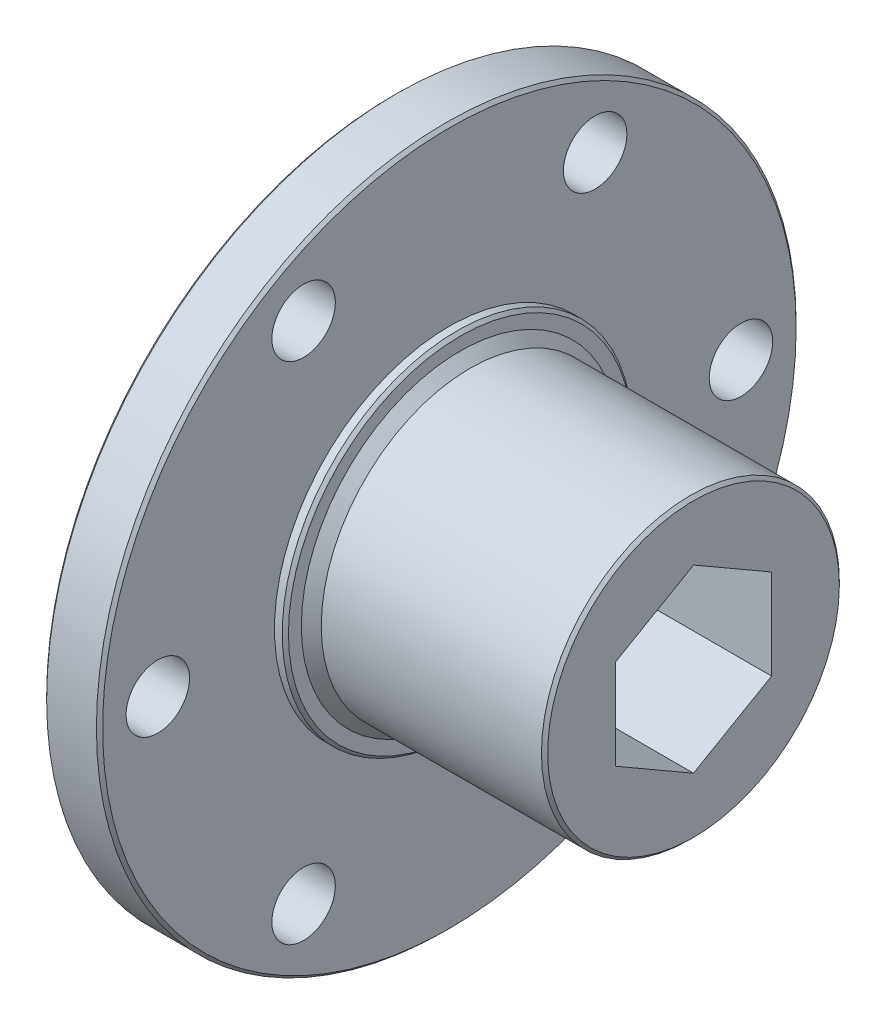
ISO-10303-21;
HEADER;
FILE_DESCRIPTION(('STEP AP214'),'2;1');
FILE_NAME('part.step','',(''),(''),'','','');
FILE_SCHEMA(('AUTOMOTIVE_DESIGN { 1 0 10303 214 1 1 1 1 }'));
ENDSEC;
DATA;
#1=APPLICATION_CONTEXT('core data for automotive mechanical design processes');
#2=APPLICATION_PROTOCOL_DEFINITION('international standard','automotive_design',2000,#1);
#3=PRODUCT_CONTEXT('',#1,'mechanical');
#4=PRODUCT('Part','Part','',(#3));
#5=PRODUCT_RELATED_PRODUCT_CATEGORY('part','',(#4));
#6=PRODUCT_DEFINITION_FORMATION('','',#4);
#7=PRODUCT_DEFINITION_CONTEXT('part definition',#1,'design');
#8=PRODUCT_DEFINITION('design','',#6,#7);
#9=PRODUCT_DEFINITION_SHAPE('','',#8);
#10=(LENGTH_UNIT() NAMED_UNIT(*) SI_UNIT(.MILLI.,.METRE.));
#11=(NAMED_UNIT(*) PLANE_ANGLE_UNIT() SI_UNIT($,.RADIAN.));
#12=(NAMED_UNIT(*) SI_UNIT($,.STERADIAN.) SOLID_ANGLE_UNIT());
#13=UNCERTAINTY_MEASURE_WITH_UNIT(LENGTH_MEASURE(1.E-05),#10,'distance_accuracy_value','');
#14=(GEOMETRIC_REPRESENTATION_CONTEXT(3) GLOBAL_UNCERTAINTY_ASSIGNED_CONTEXT((#13)) GLOBAL_UNIT_ASSIGNED_CONTEXT((#10,
#11,#12)) REPRESENTATION_CONTEXT('',''));
#15=CARTESIAN_POINT('',(0.,0.,0.));
#16=DIRECTION('',(0.,0.,1.));
#17=DIRECTION('',(1.,0.,0.));
#18=AXIS2_PLACEMENT_3D('',#15,#16,#17);
#19=CARTESIAN_POINT('',(-13.9240662460568,0.,0.));
#20=DIRECTION('',(-1.,0.,0.));
#21=DIRECTION('',(0.,0.,1.));
#22=AXIS2_PLACEMENT_3D('',#19,#20,#21);
#23=CYLINDRICAL_SURFACE('',#22,28.575);
#24=CARTESIAN_POINT('',(-18.2420662460566,0.,0.));
#25=DIRECTION('',(-1.,0.,0.));
#26=DIRECTION('',(0.,0.,1.));
#27=AXIS2_PLACEMENT_3D('',#24,#25,#26);
#28=CIRCLE('',#27,28.575);
#29=CARTESIAN_POINT('',(-18.2420662460566,0.,28.575));
#30=VERTEX_POINT('',#29);
#31=EDGE_CURVE('E169',#30,#30,#28,.F.);
#32=ORIENTED_EDGE('',*,*,#31,.T.);
#33=EDGE_LOOP('',(#32));
#34=FACE_BOUND('',#33,.T.);
#35=CARTESIAN_POINT('',(-14.1780662460569,0.,0.));
#36=DIRECTION('',(1.,0.,0.));
#37=DIRECTION('',(0.,0.,-1.));
#38=AXIS2_PLACEMENT_3D('',#35,#36,#37);
#39=CIRCLE('',#38,28.575);
#40=CARTESIAN_POINT('',(-14.1780662460569,0.,-28.575));
#41=VERTEX_POINT('',#40);
#42=EDGE_CURVE('E166',#41,#41,#39,.F.);
#43=ORIENTED_EDGE('',*,*,#42,.T.);
#44=EDGE_LOOP('',(#43));
#45=FACE_BOUND('',#44,.T.);
#46=ADVANCED_FACE('F32',(#34,#45),#23,.T.);
#47=CARTESIAN_POINT('',(-13.9240662460568,28.575,0.));
#48=DIRECTION('',(1.,0.,0.));
#49=DIRECTION('',(0.,0.,-1.));
#50=AXIS2_PLACEMENT_3D('',#47,#48,#49);
#51=PLANE('',#50);
#52=CARTESIAN_POINT('',(-13.9240662460568,0.,0.));
#53=DIRECTION('',(1.,0.,0.));
#54=DIRECTION('',(0.,0.,-1.));
#55=AXIS2_PLACEMENT_3D('',#52,#53,#54);
#56=CIRCLE('',#55,28.3209999999999);
#57=CARTESIAN_POINT('',(-13.9240662460568,0.,-28.3209999999999));
#58=VERTEX_POINT('',#57);
#59=EDGE_CURVE('E11',#58,#58,#56,.T.);
#60=ORIENTED_EDGE('',*,*,#59,.T.);
#61=EDGE_LOOP('',(#60));
#62=FACE_BOUND('',#61,.T.);
#63=CARTESIAN_POINT('',(-13.9240662460568,20.6222299276169,11.90625));
#64=DIRECTION('',(1.,0.,0.));
#65=DIRECTION('',(0.,0.,-1.));
#66=AXIS2_PLACEMENT_3D('',#63,#64,#65);
#67=CIRCLE('',#66,2.59080000000003);
#68=CARTESIAN_POINT('',(-13.9240662460568,20.6222299276169,9.31544999999998));
#69=VERTEX_POINT('',#68);
#70=EDGE_CURVE('E321',#69,#69,#67,.T.);
#71=ORIENTED_EDGE('',*,*,#70,.F.);
#72=EDGE_LOOP('',(#71));
#73=FACE_BOUND('',#72,.T.);
#74=CARTESIAN_POINT('',(-13.9240662460568,0.,-23.8125));
#75=DIRECTION('',(1.,0.,0.));
#76=DIRECTION('',(0.,0.,-1.));
#77=AXIS2_PLACEMENT_3D('',#74,#75,#76);
#78=CIRCLE('',#77,2.59080000000003);
#79=CARTESIAN_POINT('',(-13.9240662460568,0.,-26.4033));
#80=VERTEX_POINT('',#79);
#81=EDGE_CURVE('E326',#80,#80,#78,.T.);
#82=ORIENTED_EDGE('',*,*,#81,.F.);
#83=EDGE_LOOP('',(#82));
#84=FACE_BOUND('',#83,.T.);
#85=CARTESIAN_POINT('',(-13.9240662460568,-20.622229927617,11.9062499999999));
#86=DIRECTION('',(1.,0.,0.));
#87=DIRECTION('',(0.,0.,-1.));
#88=AXIS2_PLACEMENT_3D('',#85,#86,#87);
#89=CIRCLE('',#88,2.59080000000003);
#90=CARTESIAN_POINT('',(-13.9240662460568,-20.622229927617,9.31544999999992));
#91=VERTEX_POINT('',#90);
#92=EDGE_CURVE('E330',#91,#91,#89,.T.);
#93=ORIENTED_EDGE('',*,*,#92,.F.);
#94=EDGE_LOOP('',(#93));
#95=FACE_BOUND('',#94,.T.);
#96=CARTESIAN_POINT('',(-13.9240662460568,-20.6222299276169,-11.90625));
#97=DIRECTION('',(1.,0.,0.));
#98=DIRECTION('',(0.,0.,-1.));
#99=AXIS2_PLACEMENT_3D('',#96,#97,#98);
#100=CIRCLE('',#99,2.59080000000003);
#101=CARTESIAN_POINT('',(-13.9240662460568,-20.6222299276169,-14.4970500000001));
#102=VERTEX_POINT('',#101);
#103=EDGE_CURVE('E334',#102,#102,#100,.T.);
#104=ORIENTED_EDGE('',*,*,#103,.F.);
#105=EDGE_LOOP('',(#104));
#106=FACE_BOUND('',#105,.T.);
#107=CARTESIAN_POINT('',(-13.9240662460568,20.622229927617,-11.90625));
#108=DIRECTION('',(1.,0.,0.));
#109=DIRECTION('',(0.,0.,-1.));
#110=AXIS2_PLACEMENT_3D('',#107,#108,#109);
#111=CIRCLE('',#110,2.59080000000003);
#112=CARTESIAN_POINT('',(-13.9240662460568,20.622229927617,-14.49705));
#113=VERTEX_POINT('',#112);
#114=EDGE_CURVE('E338',#113,#113,#111,.T.);
#115=ORIENTED_EDGE('',*,*,#114,.F.);
#116=EDGE_LOOP('',(#115));
#117=FACE_BOUND('',#116,.T.);
#118=CARTESIAN_POINT('',(-13.9240662460568,0.,23.8125));
#119=DIRECTION('',(1.,0.,0.));
#120=DIRECTION('',(0.,0.,-1.));
#121=AXIS2_PLACEMENT_3D('',#118,#119,#120);
#122=CIRCLE('',#121,2.59080000000003);
#123=CARTESIAN_POINT('',(-13.9240662460568,0.,21.2217));
#124=VERTEX_POINT('',#123);
#125=EDGE_CURVE('E109',#124,#124,#122,.T.);
#126=ORIENTED_EDGE('',*,*,#125,.F.);
#127=EDGE_LOOP('',(#126));
#128=FACE_BOUND('',#127,.T.);
#129=CARTESIAN_POINT('',(-13.9240662460568,0.,0.));
#130=DIRECTION('',(1.,0.,0.));
#131=DIRECTION('',(0.,0.,-1.));
#132=AXIS2_PLACEMENT_3D('',#129,#130,#131);
#133=CIRCLE('',#132,14.2875);
#134=CARTESIAN_POINT('',(-13.9240662460568,0.,-14.2875));
#135=VERTEX_POINT('',#134);
#136=EDGE_CURVE('E148',#135,#135,#133,.T.);
#137=ORIENTED_EDGE('',*,*,#136,.F.);
#138=EDGE_LOOP('',(#137));
#139=FACE_BOUND('',#138,.T.);
#140=ADVANCED_FACE('F204',(#62,#73,#84,#95,#106,#117,#128,#139),#51,.T.);
#141=CARTESIAN_POINT('',(-18.4960662460568,0.,0.));
#142=DIRECTION('',(-1.,0.,0.));
#143=DIRECTION('',(0.,0.,1.));
#144=AXIS2_PLACEMENT_3D('',#141,#142,#143);
#145=PLANE('',#144);
#146=CARTESIAN_POINT('',(-18.4960662460568,0.,0.));
#147=DIRECTION('',(-1.,0.,0.));
#148=DIRECTION('',(0.,0.,1.));
#149=AXIS2_PLACEMENT_3D('',#146,#147,#148);
#150=CIRCLE('',#149,28.3209999999999);
#151=CARTESIAN_POINT('',(-18.4960662460568,0.,28.3209999999999));
#152=VERTEX_POINT('',#151);
#153=EDGE_CURVE('E163',#152,#152,#150,.T.);
#154=ORIENTED_EDGE('',*,*,#153,.T.);
#155=EDGE_LOOP('',(#154));
#156=FACE_BOUND('',#155,.T.);
#157=CARTESIAN_POINT('',(-18.4960662460568,20.6222299276169,11.90625));
#158=DIRECTION('',(-1.,0.,0.));
#159=DIRECTION('',(0.,0.,1.));
#160=AXIS2_PLACEMENT_3D('',#157,#158,#159);
#161=CIRCLE('',#160,2.59080000000003);
#162=CARTESIAN_POINT('',(-18.4960662460568,20.6222299276169,14.49705));
#163=VERTEX_POINT('',#162);
#164=EDGE_CURVE('E238',#163,#163,#161,.T.);
#165=ORIENTED_EDGE('',*,*,#164,.F.);
#166=EDGE_LOOP('',(#165));
#167=FACE_BOUND('',#166,.T.);
#168=CARTESIAN_POINT('',(-18.4960662460568,0.,-23.8125));
#169=DIRECTION('',(-1.,0.,0.));
#170=DIRECTION('',(0.,0.,1.));
#171=AXIS2_PLACEMENT_3D('',#168,#169,#170);
#172=CIRCLE('',#171,2.59080000000003);
#173=CARTESIAN_POINT('',(-18.4960662460568,0.,-21.2217));
#174=VERTEX_POINT('',#173);
#175=EDGE_CURVE('E242',#174,#174,#172,.T.);
#176=ORIENTED_EDGE('',*,*,#175,.F.);
#177=EDGE_LOOP('',(#176));
#178=FACE_BOUND('',#177,.T.);
#179=CARTESIAN_POINT('',(-18.4960662460568,-20.622229927617,11.9062499999999));
#180=DIRECTION('',(-1.,0.,0.));
#181=DIRECTION('',(0.,0.,1.));
#182=AXIS2_PLACEMENT_3D('',#179,#180,#181);
#183=CIRCLE('',#182,2.59080000000003);
#184=CARTESIAN_POINT('',(-18.4960662460568,-20.622229927617,14.49705));
#185=VERTEX_POINT('',#184);
#186=EDGE_CURVE('E246',#185,#185,#183,.T.);
#187=ORIENTED_EDGE('',*,*,#186,.F.);
#188=EDGE_LOOP('',(#187));
#189=FACE_BOUND('',#188,.T.);
#190=CARTESIAN_POINT('',(-18.4960662460568,-20.6222299276169,-11.90625));
#191=DIRECTION('',(-1.,0.,0.));
#192=DIRECTION('',(0.,0.,1.));
#193=AXIS2_PLACEMENT_3D('',#190,#191,#192);
#194=CIRCLE('',#193,2.59080000000003);
#195=CARTESIAN_POINT('',(-18.4960662460568,-20.6222299276169,-9.31545000000002));
#196=VERTEX_POINT('',#195);
#197=EDGE_CURVE('E250',#196,#196,#194,.T.);
#198=ORIENTED_EDGE('',*,*,#197,.F.);
#199=EDGE_LOOP('',(#198));
#200=FACE_BOUND('',#199,.T.);
#201=CARTESIAN_POINT('',(-18.4960662460568,20.622229927617,-11.90625));
#202=DIRECTION('',(-1.,0.,0.));
#203=DIRECTION('',(0.,0.,1.));
#204=AXIS2_PLACEMENT_3D('',#201,#202,#203);
#205=CIRCLE('',#204,2.59080000000003);
#206=CARTESIAN_POINT('',(-18.4960662460568,20.622229927617,-9.31544999999995));
#207=VERTEX_POINT('',#206);
#208=EDGE_CURVE('E254',#207,#207,#205,.T.);
#209=ORIENTED_EDGE('',*,*,#208,.F.);
#210=EDGE_LOOP('',(#209));
#211=FACE_BOUND('',#210,.T.);
#212=CARTESIAN_POINT('',(-18.4960662460568,0.,23.8125));
#213=DIRECTION('',(-1.,0.,0.));
#214=DIRECTION('',(0.,0.,1.));
#215=AXIS2_PLACEMENT_3D('',#212,#213,#214);
#216=CIRCLE('',#215,2.59080000000003);
#217=CARTESIAN_POINT('',(-18.4960662460568,0.,26.4033));
#218=VERTEX_POINT('',#217);
#219=EDGE_CURVE('E258',#218,#218,#216,.T.);
#220=ORIENTED_EDGE('',*,*,#219,.F.);
#221=EDGE_LOOP('',(#220));
#222=FACE_BOUND('',#221,.T.);
#223=CARTESIAN_POINT('',(-18.4960662460568,0.,0.));
#224=DIRECTION('',(-1.,0.,0.));
#225=DIRECTION('',(0.,0.,1.));
#226=AXIS2_PLACEMENT_3D('',#223,#224,#225);
#227=CIRCLE('',#226,14.2875);
#228=CARTESIAN_POINT('',(-18.4960662460568,0.,14.2875));
#229=VERTEX_POINT('',#228);
#230=EDGE_CURVE('E132',#229,#229,#227,.T.);
#231=ORIENTED_EDGE('',*,*,#230,.F.);
#232=EDGE_LOOP('',(#231));
#233=FACE_BOUND('',#232,.T.);
#234=ADVANCED_FACE('F210',(#156,#167,#178,#189,#200,#211,#222,#233),#145,.T.);
#235=CARTESIAN_POINT('',(-13.0350662460568,0.,0.));
#236=DIRECTION('',(-1.,0.,0.));
#237=DIRECTION('',(0.,0.,1.));
#238=AXIS2_PLACEMENT_3D('',#235,#236,#237);
#239=CYLINDRICAL_SURFACE('',#238,14.2875);
#240=CARTESIAN_POINT('',(-13.2890662460569,0.,0.));
#241=DIRECTION('',(1.,0.,0.));
#242=DIRECTION('',(0.,0.,-1.));
#243=AXIS2_PLACEMENT_3D('',#240,#241,#242);
#244=CIRCLE('',#243,14.2875);
#245=CARTESIAN_POINT('',(-13.2890662460569,0.,-14.2875));
#246=VERTEX_POINT('',#245);
#247=EDGE_CURVE('E40',#246,#246,#244,.F.);
#248=ORIENTED_EDGE('',*,*,#247,.T.);
#249=EDGE_LOOP('',(#248));
#250=FACE_BOUND('',#249,.T.);
#251=ORIENTED_EDGE('',*,*,#136,.T.);
#252=EDGE_LOOP('',(#251));
#253=FACE_BOUND('',#252,.T.);
#254=ADVANCED_FACE('F177',(#250,#253),#239,.T.);
#255=CARTESIAN_POINT('',(-13.0350662460568,0.,0.));
#256=DIRECTION('',(1.,0.,0.));
#257=DIRECTION('',(0.,0.,-1.));
#258=AXIS2_PLACEMENT_3D('',#255,#256,#257);
#259=PLANE('',#258);
#260=CARTESIAN_POINT('',(-13.0350662460568,0.,0.));
#261=DIRECTION('',(1.,0.,0.));
#262=DIRECTION('',(0.,0.,-1.));
#263=AXIS2_PLACEMENT_3D('',#260,#261,#262);
#264=CIRCLE('',#263,14.0334999999999);
#265=CARTESIAN_POINT('',(-13.0350662460568,0.,-14.0334999999999));
#266=VERTEX_POINT('',#265);
#267=EDGE_CURVE('E172',#266,#266,#264,.T.);
#268=ORIENTED_EDGE('',*,*,#267,.T.);
#269=EDGE_LOOP('',(#268));
#270=FACE_BOUND('',#269,.T.);
#271=CARTESIAN_POINT('',(-13.0350662460568,0.,0.));
#272=DIRECTION('',(1.,0.,0.));
#273=DIRECTION('',(0.,0.,-1.));
#274=AXIS2_PLACEMENT_3D('',#271,#272,#273);
#275=CIRCLE('',#274,12.9794);
#276=CARTESIAN_POINT('',(-13.0350662460568,0.,-12.9794));
#277=VERTEX_POINT('',#276);
#278=EDGE_CURVE('E142',#277,#277,#275,.T.);
#279=ORIENTED_EDGE('',*,*,#278,.F.);
#280=EDGE_LOOP('',(#279));
#281=FACE_BOUND('',#280,.T.);
#282=ADVANCED_FACE('F186',(#270,#281),#259,.T.);
#283=CARTESIAN_POINT('',(-13.0350662460568,0.,0.));
#284=DIRECTION('',(-1.,0.,0.));
#285=DIRECTION('',(0.,0.,-1.));
#286=AXIS2_PLACEMENT_3D('',#283,#284,#285);
#287=CONICAL_SURFACE('',#286,12.9794,0.785398163397434);
#288=CARTESIAN_POINT('',(-12.2222662460567,0.,0.));
#289=DIRECTION('',(1.,0.,0.));
#290=DIRECTION('',(0.,0.,-1.));
#291=AXIS2_PLACEMENT_3D('',#288,#289,#290);
#292=CIRCLE('',#291,12.1666);
#293=CARTESIAN_POINT('',(-12.2222662460567,0.,-12.1666));
#294=VERTEX_POINT('',#293);
#295=EDGE_CURVE('E145',#294,#294,#292,.T.);
#296=ORIENTED_EDGE('',*,*,#295,.F.);
#297=EDGE_LOOP('',(#296));
#298=FACE_BOUND('',#297,.T.);
#299=ORIENTED_EDGE('',*,*,#278,.T.);
#300=EDGE_LOOP('',(#299));
#301=FACE_BOUND('',#300,.T.);
#302=ADVANCED_FACE('F189',(#298,#301),#287,.T.);
#303=CARTESIAN_POINT('',(6.01493375394323,0.,0.));
#304=DIRECTION('',(-1.,0.,0.));
#305=DIRECTION('',(0.,0.,1.));
#306=AXIS2_PLACEMENT_3D('',#303,#304,#305);
#307=CYLINDRICAL_SURFACE('',#306,12.1666);
#308=CARTESIAN_POINT('',(5.76093375394317,0.,0.));
#309=DIRECTION('',(1.,0.,0.));
#310=DIRECTION('',(0.,0.,-1.));
#311=AXIS2_PLACEMENT_3D('',#308,#309,#310);
#312=CIRCLE('',#311,12.1666);
#313=CARTESIAN_POINT('',(5.76093375394317,0.,-12.1666));
#314=VERTEX_POINT('',#313);
#315=EDGE_CURVE('E160',#314,#314,#312,.F.);
#316=ORIENTED_EDGE('',*,*,#315,.T.);
#317=EDGE_LOOP('',(#316));
#318=FACE_BOUND('',#317,.T.);
#319=ORIENTED_EDGE('',*,*,#295,.T.);
#320=EDGE_LOOP('',(#319));
#321=FACE_BOUND('',#320,.T.);
#322=ADVANCED_FACE('F194',(#318,#321),#307,.T.);
#323=CARTESIAN_POINT('',(6.01493375394323,0.,0.));
#324=DIRECTION('',(1.,0.,0.));
#325=DIRECTION('',(0.,0.,-1.));
#326=AXIS2_PLACEMENT_3D('',#323,#324,#325);
#327=PLANE('',#326);
#328=CARTESIAN_POINT('',(6.01493375394323,0.,0.));
#329=DIRECTION('',(1.,0.,0.));
#330=DIRECTION('',(0.,0.,-1.));
#331=AXIS2_PLACEMENT_3D('',#328,#329,#330);
#332=CIRCLE('',#331,11.9125999999999);
#333=CARTESIAN_POINT('',(6.01493375394323,0.,-11.9125999999999));
#334=VERTEX_POINT('',#333);
#335=EDGE_CURVE('E157',#334,#334,#332,.T.);
#336=ORIENTED_EDGE('',*,*,#335,.T.);
#337=EDGE_LOOP('',(#336));
#338=FACE_BOUND('',#337,.T.);
#339=DIRECTION('',(0.,0.500000000000001,-0.866025403784438));
#340=VECTOR('',#339,1.);
#341=CARTESIAN_POINT('',(6.01493375394323,3.68081890619155,6.3754));
#342=LINE('',#341,#340);
#343=CARTESIAN_POINT('',(6.01493375394323,3.68081890619155,6.3754));
#344=VERTEX_POINT('',#343);
#345=CARTESIAN_POINT('',(6.01493375394323,7.3616578123831,0.));
#346=VERTEX_POINT('',#345);
#347=EDGE_CURVE('E87',#344,#346,#342,.T.);
#348=ORIENTED_EDGE('',*,*,#347,.T.);
#349=DIRECTION('',(0.,-0.500000000000001,-0.866025403784438));
#350=VECTOR('',#349,1.);
#351=CARTESIAN_POINT('',(6.01493375394323,7.3616578123831,0.));
#352=LINE('',#351,#350);
#353=CARTESIAN_POINT('',(6.01493375394323,3.68081890619154,-6.37539999999999));
#354=VERTEX_POINT('',#353);
#355=EDGE_CURVE('E96',#346,#354,#352,.T.);
#356=ORIENTED_EDGE('',*,*,#355,.T.);
#357=DIRECTION('',(0.,-1.,0.));
#358=VECTOR('',#357,1.);
#359=CARTESIAN_POINT('',(6.01493375394323,3.68081890619155,-6.37539999999999));
#360=LINE('',#359,#358);
#361=CARTESIAN_POINT('',(6.01493375394323,-3.68085890619153,-6.37539999999999));
#362=VERTEX_POINT('',#361);
#363=EDGE_CURVE('E47',#354,#362,#360,.T.);
#364=ORIENTED_EDGE('',*,*,#363,.T.);
#365=DIRECTION('',(0.,-0.500000000000001,0.866025403784438));
#366=VECTOR('',#365,1.);
#367=CARTESIAN_POINT('',(6.01493375394323,-3.68085890619153,-6.37539999999999));
#368=LINE('',#367,#366);
#369=CARTESIAN_POINT('',(6.01493375394323,-7.36169781238308,0.));
#370=VERTEX_POINT('',#369);
#371=EDGE_CURVE('E113',#362,#370,#368,.T.);
#372=ORIENTED_EDGE('',*,*,#371,.T.);
#373=DIRECTION('',(0.,0.500000000000001,0.866025403784438));
#374=VECTOR('',#373,1.);
#375=CARTESIAN_POINT('',(6.01493375394323,-7.36169781238308,0.));
#376=LINE('',#375,#374);
#377=CARTESIAN_POINT('',(6.01493375394323,-3.68085890619153,6.3754));
#378=VERTEX_POINT('',#377);
#379=EDGE_CURVE('E116',#370,#378,#376,.T.);
#380=ORIENTED_EDGE('',*,*,#379,.T.);
#381=DIRECTION('',(0.,1.,0.));
#382=VECTOR('',#381,1.);
#383=CARTESIAN_POINT('',(6.01493375394323,-3.68085890619153,6.3754));
#384=LINE('',#383,#382);
#385=EDGE_CURVE('E93',#378,#344,#384,.T.);
#386=ORIENTED_EDGE('',*,*,#385,.T.);
#387=EDGE_LOOP('',(#348,#356,#364,#372,#380,#386));
#388=FACE_BOUND('',#387,.T.);
#389=ADVANCED_FACE('F100',(#338,#388),#327,.T.);
#390=CARTESIAN_POINT('',(-19.3850662460568,0.,0.));
#391=DIRECTION('',(1.,0.,0.));
#392=DIRECTION('',(0.,0.,-1.));
#393=AXIS2_PLACEMENT_3D('',#390,#391,#392);
#394=CYLINDRICAL_SURFACE('',#393,14.2875);
#395=CARTESIAN_POINT('',(-19.1310662460567,0.,0.));
#396=DIRECTION('',(-1.,0.,0.));
#397=DIRECTION('',(0.,0.,1.));
#398=AXIS2_PLACEMENT_3D('',#395,#396,#397);
#399=CIRCLE('',#398,14.2875);
#400=CARTESIAN_POINT('',(-19.1310662460567,0.,14.2875));
#401=VERTEX_POINT('',#400);
#402=EDGE_CURVE('E154',#401,#401,#399,.F.);
#403=ORIENTED_EDGE('',*,*,#402,.T.);
#404=EDGE_LOOP('',(#403));
#405=FACE_BOUND('',#404,.T.);
#406=ORIENTED_EDGE('',*,*,#230,.T.);
#407=EDGE_LOOP('',(#406));
#408=FACE_BOUND('',#407,.T.);
#409=ADVANCED_FACE('F261',(#405,#408),#394,.T.);
#410=CARTESIAN_POINT('',(-19.3850662460568,0.,0.));
#411=DIRECTION('',(-1.,0.,0.));
#412=DIRECTION('',(0.,0.,1.));
#413=AXIS2_PLACEMENT_3D('',#410,#411,#412);
#414=PLANE('',#413);
#415=CARTESIAN_POINT('',(-19.3850662460568,0.,0.));
#416=DIRECTION('',(-1.,0.,0.));
#417=DIRECTION('',(0.,0.,1.));
#418=AXIS2_PLACEMENT_3D('',#415,#416,#417);
#419=CIRCLE('',#418,14.0334999999999);
#420=CARTESIAN_POINT('',(-19.3850662460568,0.,14.0334999999999));
#421=VERTEX_POINT('',#420);
#422=EDGE_CURVE('E151',#421,#421,#419,.T.);
#423=ORIENTED_EDGE('',*,*,#422,.T.);
#424=EDGE_LOOP('',(#423));
#425=FACE_BOUND('',#424,.T.);
#426=DIRECTION('',(0.,0.500000000000001,-0.866025403784438));
#427=VECTOR('',#426,1.);
#428=CARTESIAN_POINT('',(-19.3850662460568,3.68081890619155,6.3754));
#429=LINE('',#428,#427);
#430=CARTESIAN_POINT('',(-19.3850662460568,3.68081890619155,6.3754));
#431=VERTEX_POINT('',#430);
#432=CARTESIAN_POINT('',(-19.3850662460568,7.36165781238309,0.));
#433=VERTEX_POINT('',#432);
#434=EDGE_CURVE('E55',#431,#433,#429,.T.);
#435=ORIENTED_EDGE('',*,*,#434,.F.);
#436=DIRECTION('',(0.,1.,0.));
#437=VECTOR('',#436,1.);
#438=CARTESIAN_POINT('',(-19.3850662460568,-3.68085890619153,6.3754));
#439=LINE('',#438,#437);
#440=CARTESIAN_POINT('',(-19.3850662460568,-3.68085890619153,6.3754));
#441=VERTEX_POINT('',#440);
#442=EDGE_CURVE('E103',#441,#431,#439,.T.);
#443=ORIENTED_EDGE('',*,*,#442,.F.);
#444=DIRECTION('',(0.,0.500000000000001,0.866025403784438));
#445=VECTOR('',#444,1.);
#446=CARTESIAN_POINT('',(-19.3850662460568,-7.36169781238308,0.));
#447=LINE('',#446,#445);
#448=CARTESIAN_POINT('',(-19.3850662460568,-7.36169781238308,0.));
#449=VERTEX_POINT('',#448);
#450=EDGE_CURVE('E106',#449,#441,#447,.T.);
#451=ORIENTED_EDGE('',*,*,#450,.F.);
#452=DIRECTION('',(0.,-0.500000000000001,0.866025403784438));
#453=VECTOR('',#452,1.);
#454=CARTESIAN_POINT('',(-19.3850662460568,-3.68085890619153,-6.37539999999999));
#455=LINE('',#454,#453);
#456=CARTESIAN_POINT('',(-19.3850662460568,-3.68085890619153,-6.37539999999999));
#457=VERTEX_POINT('',#456);
#458=EDGE_CURVE('E125',#457,#449,#455,.T.);
#459=ORIENTED_EDGE('',*,*,#458,.F.);
#460=DIRECTION('',(0.,-1.,0.));
#461=VECTOR('',#460,1.);
#462=CARTESIAN_POINT('',(-19.3850662460568,3.68081890619155,-6.37539999999999));
#463=LINE('',#462,#461);
#464=CARTESIAN_POINT('',(-19.3850662460568,3.68081890619155,-6.37539999999999));
#465=VERTEX_POINT('',#464);
#466=EDGE_CURVE('E122',#465,#457,#463,.T.);
#467=ORIENTED_EDGE('',*,*,#466,.F.);
#468=DIRECTION('',(0.,-0.500000000000001,-0.866025403784438));
#469=VECTOR('',#468,1.);
#470=CARTESIAN_POINT('',(-19.3850662460568,7.3616578123831,0.));
#471=LINE('',#470,#469);
#472=EDGE_CURVE('E120',#433,#465,#471,.T.);
#473=ORIENTED_EDGE('',*,*,#472,.F.);
#474=EDGE_LOOP('',(#435,#443,#451,#459,#467,#473));
#475=FACE_BOUND('',#474,.T.);
#476=ADVANCED_FACE('F263',(#425,#475),#414,.T.);
#477=CARTESIAN_POINT('',(6.01493375394323,3.68081890619155,6.3754));
#478=DIRECTION('',(0.,0.866025403784438,0.500000000000001));
#479=DIRECTION('',(0.,-0.500000000000001,0.866025403784438));
#480=AXIS2_PLACEMENT_3D('',#477,#478,#479);
#481=PLANE('',#480);
#482=ORIENTED_EDGE('',*,*,#434,.T.);
#483=DIRECTION('',(-1.,0.,0.));
#484=VECTOR('',#483,1.);
#485=CARTESIAN_POINT('',(6.01493375394323,7.3616578123831,0.));
#486=LINE('',#485,#484);
#487=EDGE_CURVE('E83',#346,#433,#486,.T.);
#488=ORIENTED_EDGE('',*,*,#487,.F.);
#489=ORIENTED_EDGE('',*,*,#347,.F.);
#490=DIRECTION('',(-1.,0.,0.));
#491=VECTOR('',#490,1.);
#492=CARTESIAN_POINT('',(6.01493375394323,3.68081890619155,6.3754));
#493=LINE('',#492,#491);
#494=EDGE_CURVE('E130',#344,#431,#493,.T.);
#495=ORIENTED_EDGE('',*,*,#494,.T.);
#496=EDGE_LOOP('',(#482,#488,#489,#495));
#497=FACE_BOUND('',#496,.T.);
#498=ADVANCED_FACE('F85',(#497),#481,.F.);
#499=CARTESIAN_POINT('',(6.01493375394323,-3.68085890619153,6.3754));
#500=DIRECTION('',(0.,0.,1.));
#501=DIRECTION('',(0.,-1.,0.));
#502=AXIS2_PLACEMENT_3D('',#499,#500,#501);
#503=PLANE('',#502);
#504=ORIENTED_EDGE('',*,*,#442,.T.);
#505=ORIENTED_EDGE('',*,*,#494,.F.);
#506=ORIENTED_EDGE('',*,*,#385,.F.);
#507=DIRECTION('',(-1.,0.,0.));
#508=VECTOR('',#507,1.);
#509=CARTESIAN_POINT('',(6.01493375394323,-3.68085890619153,6.3754));
#510=LINE('',#509,#508);
#511=EDGE_CURVE('E133',#378,#441,#510,.T.);
#512=ORIENTED_EDGE('',*,*,#511,.T.);
#513=EDGE_LOOP('',(#504,#505,#506,#512));
#514=FACE_BOUND('',#513,.T.);
#515=ADVANCED_FACE('F277',(#514),#503,.F.);
#516=CARTESIAN_POINT('',(6.01493375394323,-7.36169781238308,0.));
#517=DIRECTION('',(0.,-0.866025403784438,0.500000000000001));
#518=DIRECTION('',(0.,-0.500000000000001,-0.866025403784438));
#519=AXIS2_PLACEMENT_3D('',#516,#517,#518);
#520=PLANE('',#519);
#521=ORIENTED_EDGE('',*,*,#450,.T.);
#522=ORIENTED_EDGE('',*,*,#511,.F.);
#523=ORIENTED_EDGE('',*,*,#379,.F.);
#524=DIRECTION('',(-1.,0.,0.));
#525=VECTOR('',#524,1.);
#526=CARTESIAN_POINT('',(6.01493375394323,-7.36169781238308,0.));
#527=LINE('',#526,#525);
#528=EDGE_CURVE('E135',#370,#449,#527,.T.);
#529=ORIENTED_EDGE('',*,*,#528,.T.);
#530=EDGE_LOOP('',(#521,#522,#523,#529));
#531=FACE_BOUND('',#530,.T.);
#532=ADVANCED_FACE('F287',(#531),#520,.F.);
#533=CARTESIAN_POINT('',(6.01493375394323,-3.68085890619153,-6.37539999999999));
#534=DIRECTION('',(0.,-0.866025403784438,-0.500000000000001));
#535=DIRECTION('',(0.,0.500000000000001,-0.866025403784438));
#536=AXIS2_PLACEMENT_3D('',#533,#534,#535);
#537=PLANE('',#536);
#538=ORIENTED_EDGE('',*,*,#458,.T.);
#539=ORIENTED_EDGE('',*,*,#528,.F.);
#540=ORIENTED_EDGE('',*,*,#371,.F.);
#541=DIRECTION('',(-1.,0.,0.));
#542=VECTOR('',#541,1.);
#543=CARTESIAN_POINT('',(6.01493375394323,-3.68085890619153,-6.37539999999999));
#544=LINE('',#543,#542);
#545=EDGE_CURVE('E137',#362,#457,#544,.T.);
#546=ORIENTED_EDGE('',*,*,#545,.T.);
#547=EDGE_LOOP('',(#538,#539,#540,#546));
#548=FACE_BOUND('',#547,.T.);
#549=ADVANCED_FACE('F284',(#548),#537,.F.);
#550=CARTESIAN_POINT('',(6.01493375394323,3.68081890619155,-6.37539999999999));
#551=DIRECTION('',(0.,0.,-1.));
#552=DIRECTION('',(0.,1.,0.));
#553=AXIS2_PLACEMENT_3D('',#550,#551,#552);
#554=PLANE('',#553);
#555=ORIENTED_EDGE('',*,*,#466,.T.);
#556=ORIENTED_EDGE('',*,*,#545,.F.);
#557=ORIENTED_EDGE('',*,*,#363,.F.);
#558=DIRECTION('',(-1.,0.,0.));
#559=VECTOR('',#558,1.);
#560=CARTESIAN_POINT('',(6.01493375394323,3.68081890619155,-6.37539999999999));
#561=LINE('',#560,#559);
#562=EDGE_CURVE('E92',#354,#465,#561,.T.);
#563=ORIENTED_EDGE('',*,*,#562,.T.);
#564=EDGE_LOOP('',(#555,#556,#557,#563));
#565=FACE_BOUND('',#564,.T.);
#566=ADVANCED_FACE('F281',(#565),#554,.F.);
#567=CARTESIAN_POINT('',(6.01493375394323,7.3616578123831,0.));
#568=DIRECTION('',(0.,0.866025403784438,-0.500000000000001));
#569=DIRECTION('',(0.,0.500000000000001,0.866025403784438));
#570=AXIS2_PLACEMENT_3D('',#567,#568,#569);
#571=PLANE('',#570);
#572=ORIENTED_EDGE('',*,*,#472,.T.);
#573=ORIENTED_EDGE('',*,*,#562,.F.);
#574=ORIENTED_EDGE('',*,*,#355,.F.);
#575=ORIENTED_EDGE('',*,*,#487,.T.);
#576=EDGE_LOOP('',(#572,#573,#574,#575));
#577=FACE_BOUND('',#576,.T.);
#578=ADVANCED_FACE('F97',(#577),#571,.F.);
#579=CARTESIAN_POINT('',(-18.4960662460568,0.,23.8125));
#580=DIRECTION('',(-1.,0.,0.));
#581=DIRECTION('',(0.,0.,1.));
#582=AXIS2_PLACEMENT_3D('',#579,#580,#581);
#583=CYLINDRICAL_SURFACE('',#582,2.59080000000003);
#584=ORIENTED_EDGE('',*,*,#125,.T.);
#585=EDGE_LOOP('',(#584));
#586=FACE_BOUND('',#585,.T.);
#587=ORIENTED_EDGE('',*,*,#219,.T.);
#588=EDGE_LOOP('',(#587));
#589=FACE_BOUND('',#588,.T.);
#590=ADVANCED_FACE('F280',(#586,#589),#583,.F.);
#591=CARTESIAN_POINT('',(-18.4960662460568,20.622229927617,-11.90625));
#592=DIRECTION('',(-1.,0.,0.));
#593=DIRECTION('',(0.,0.,1.));
#594=AXIS2_PLACEMENT_3D('',#591,#592,#593);
#595=CYLINDRICAL_SURFACE('',#594,2.59080000000003);
#596=ORIENTED_EDGE('',*,*,#114,.T.);
#597=EDGE_LOOP('',(#596));
#598=FACE_BOUND('',#597,.T.);
#599=ORIENTED_EDGE('',*,*,#208,.T.);
#600=EDGE_LOOP('',(#599));
#601=FACE_BOUND('',#600,.T.);
#602=ADVANCED_FACE('F297',(#598,#601),#595,.F.);
#603=CARTESIAN_POINT('',(-18.4960662460568,-20.6222299276169,-11.90625));
#604=DIRECTION('',(-1.,0.,0.));
#605=DIRECTION('',(0.,0.,1.));
#606=AXIS2_PLACEMENT_3D('',#603,#604,#605);
#607=CYLINDRICAL_SURFACE('',#606,2.59080000000003);
#608=ORIENTED_EDGE('',*,*,#103,.T.);
#609=EDGE_LOOP('',(#608));
#610=FACE_BOUND('',#609,.T.);
#611=ORIENTED_EDGE('',*,*,#197,.T.);
#612=EDGE_LOOP('',(#611));
#613=FACE_BOUND('',#612,.T.);
#614=ADVANCED_FACE('F301',(#610,#613),#607,.F.);
#615=CARTESIAN_POINT('',(-18.4960662460568,-20.622229927617,11.9062499999999));
#616=DIRECTION('',(-1.,0.,0.));
#617=DIRECTION('',(0.,0.,1.));
#618=AXIS2_PLACEMENT_3D('',#615,#616,#617);
#619=CYLINDRICAL_SURFACE('',#618,2.59080000000003);
#620=ORIENTED_EDGE('',*,*,#92,.T.);
#621=EDGE_LOOP('',(#620));
#622=FACE_BOUND('',#621,.T.);
#623=ORIENTED_EDGE('',*,*,#186,.T.);
#624=EDGE_LOOP('',(#623));
#625=FACE_BOUND('',#624,.T.);
#626=ADVANCED_FACE('F305',(#622,#625),#619,.F.);
#627=CARTESIAN_POINT('',(-18.4960662460568,0.,-23.8125));
#628=DIRECTION('',(-1.,0.,0.));
#629=DIRECTION('',(0.,0.,1.));
#630=AXIS2_PLACEMENT_3D('',#627,#628,#629);
#631=CYLINDRICAL_SURFACE('',#630,2.59080000000003);
#632=ORIENTED_EDGE('',*,*,#81,.T.);
#633=EDGE_LOOP('',(#632));
#634=FACE_BOUND('',#633,.T.);
#635=ORIENTED_EDGE('',*,*,#175,.T.);
#636=EDGE_LOOP('',(#635));
#637=FACE_BOUND('',#636,.T.);
#638=ADVANCED_FACE('F309',(#634,#637),#631,.F.);
#639=CARTESIAN_POINT('',(-18.4960662460568,20.6222299276169,11.90625));
#640=DIRECTION('',(-1.,0.,0.));
#641=DIRECTION('',(0.,0.,1.));
#642=AXIS2_PLACEMENT_3D('',#639,#640,#641);
#643=CYLINDRICAL_SURFACE('',#642,2.59080000000003);
#644=ORIENTED_EDGE('',*,*,#70,.T.);
#645=EDGE_LOOP('',(#644));
#646=FACE_BOUND('',#645,.T.);
#647=ORIENTED_EDGE('',*,*,#164,.T.);
#648=EDGE_LOOP('',(#647));
#649=FACE_BOUND('',#648,.T.);
#650=ADVANCED_FACE('F220',(#646,#649),#643,.F.);
#651=CARTESIAN_POINT('',(-19.3850662460568,0.,0.));
#652=DIRECTION('',(1.,0.,0.));
#653=DIRECTION('',(0.,0.,-1.));
#654=AXIS2_PLACEMENT_3D('',#651,#652,#653);
#655=CONICAL_SURFACE('',#654,14.0334999999999,0.785398163397448);
#656=ORIENTED_EDGE('',*,*,#402,.F.);
#657=EDGE_LOOP('',(#656));
#658=FACE_BOUND('',#657,.T.);
#659=ORIENTED_EDGE('',*,*,#422,.F.);
#660=EDGE_LOOP('',(#659));
#661=FACE_BOUND('',#660,.T.);
#662=ADVANCED_FACE('F216',(#658,#661),#655,.T.);
#663=CARTESIAN_POINT('',(6.01493375394323,0.,0.));
#664=DIRECTION('',(-1.,0.,0.));
#665=DIRECTION('',(0.,0.,1.));
#666=AXIS2_PLACEMENT_3D('',#663,#664,#665);
#667=CONICAL_SURFACE('',#666,11.9125999999999,0.785398163397452);
#668=ORIENTED_EDGE('',*,*,#315,.F.);
#669=EDGE_LOOP('',(#668));
#670=FACE_BOUND('',#669,.T.);
#671=ORIENTED_EDGE('',*,*,#335,.F.);
#672=EDGE_LOOP('',(#671));
#673=FACE_BOUND('',#672,.T.);
#674=ADVANCED_FACE('F219',(#670,#673),#667,.T.);
#675=CARTESIAN_POINT('',(-18.4960662460568,0.,0.));
#676=DIRECTION('',(1.,0.,0.));
#677=DIRECTION('',(0.,0.,-1.));
#678=AXIS2_PLACEMENT_3D('',#675,#676,#677);
#679=CONICAL_SURFACE('',#678,28.3209999999999,0.785398163397455);
#680=ORIENTED_EDGE('',*,*,#31,.F.);
#681=EDGE_LOOP('',(#680));
#682=FACE_BOUND('',#681,.T.);
#683=ORIENTED_EDGE('',*,*,#153,.F.);
#684=EDGE_LOOP('',(#683));
#685=FACE_BOUND('',#684,.T.);
#686=ADVANCED_FACE('F183',(#682,#685),#679,.T.);
#687=CARTESIAN_POINT('',(-13.0350662460568,0.,0.));
#688=DIRECTION('',(-1.,0.,0.));
#689=DIRECTION('',(0.,0.,1.));
#690=AXIS2_PLACEMENT_3D('',#687,#688,#689);
#691=CONICAL_SURFACE('',#690,14.0334999999999,0.785398163397445);
#692=ORIENTED_EDGE('',*,*,#247,.F.);
#693=EDGE_LOOP('',(#692));
#694=FACE_BOUND('',#693,.T.);
#695=ORIENTED_EDGE('',*,*,#267,.F.);
#696=EDGE_LOOP('',(#695));
#697=FACE_BOUND('',#696,.T.);
#698=ADVANCED_FACE('F180',(#694,#697),#691,.T.);
#699=CARTESIAN_POINT('',(-14.1780662460569,0.,0.));
#700=DIRECTION('',(-1.,0.,0.));
#701=DIRECTION('',(0.,0.,1.));
#702=AXIS2_PLACEMENT_3D('',#699,#700,#701);
#703=CONICAL_SURFACE('',#702,28.575,0.785398163397455);
#704=ORIENTED_EDGE('',*,*,#59,.F.);
#705=EDGE_LOOP('',(#704));
#706=FACE_BOUND('',#705,.T.);
#707=ORIENTED_EDGE('',*,*,#42,.F.);
#708=EDGE_LOOP('',(#707));
#709=FACE_BOUND('',#708,.T.);
#710=ADVANCED_FACE('F34',(#706,#709),#703,.T.);
#711=CLOSED_SHELL('',(#46,#140,#234,#254,#282,#302,#322,#389,#409,#476,#498,#515,#532,#549,#566,
#578,#590,#602,#614,#626,#638,#650,#662,#674,#686,#698,#710));
#712=MANIFOLD_SOLID_BREP('B2',#711);
#713=ADVANCED_BREP_SHAPE_REPRESENTATION('',(#18,#712),#14);
#714=SHAPE_DEFINITION_REPRESENTATION(#9,#713);
ENDSEC;
END-ISO-10303-21;
